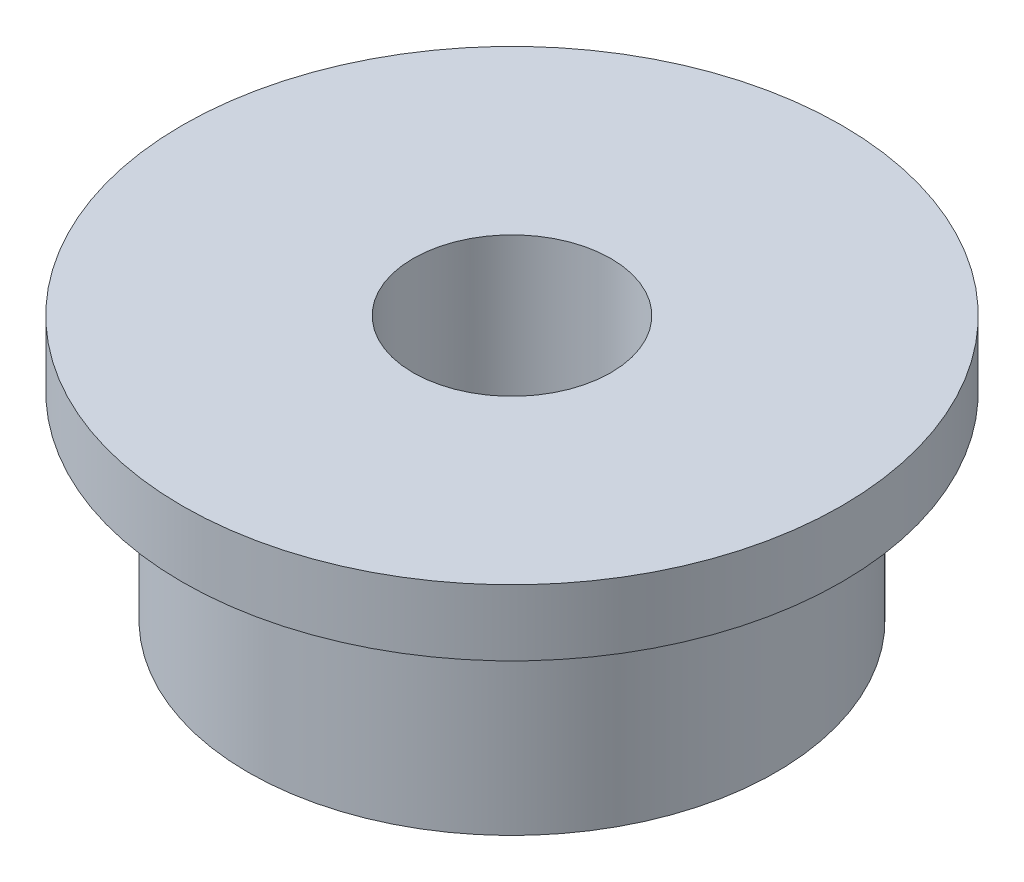
ISO-10303-21;
HEADER;
FILE_DESCRIPTION(('STEP AP214'),'2;1');
FILE_NAME('part.step','',(''),(''),'','','');
FILE_SCHEMA(('AUTOMOTIVE_DESIGN { 1 0 10303 214 1 1 1 1 }'));
ENDSEC;
DATA;
#1=APPLICATION_CONTEXT('core data for automotive mechanical design processes');
#2=APPLICATION_PROTOCOL_DEFINITION('international standard','automotive_design',2000,#1);
#3=PRODUCT_CONTEXT('',#1,'mechanical');
#4=PRODUCT('Part','Part','',(#3));
#5=PRODUCT_RELATED_PRODUCT_CATEGORY('part','',(#4));
#6=PRODUCT_DEFINITION_FORMATION('','',#4);
#7=PRODUCT_DEFINITION_CONTEXT('part definition',#1,'design');
#8=PRODUCT_DEFINITION('design','',#6,#7);
#9=PRODUCT_DEFINITION_SHAPE('','',#8);
#10=(LENGTH_UNIT() NAMED_UNIT(*) SI_UNIT(.MILLI.,.METRE.));
#11=(NAMED_UNIT(*) PLANE_ANGLE_UNIT() SI_UNIT($,.RADIAN.));
#12=(NAMED_UNIT(*) SI_UNIT($,.STERADIAN.) SOLID_ANGLE_UNIT());
#13=UNCERTAINTY_MEASURE_WITH_UNIT(LENGTH_MEASURE(1.E-05),#10,'distance_accuracy_value','');
#14=(GEOMETRIC_REPRESENTATION_CONTEXT(3) GLOBAL_UNCERTAINTY_ASSIGNED_CONTEXT((#13)) GLOBAL_UNIT_ASSIGNED_CONTEXT((#10,
#11,#12)) REPRESENTATION_CONTEXT('',''));
#15=CARTESIAN_POINT('',(0.,0.,0.));
#16=DIRECTION('',(0.,0.,1.));
#17=DIRECTION('',(1.,0.,0.));
#18=AXIS2_PLACEMENT_3D('',#15,#16,#17);
#19=CARTESIAN_POINT('',(0.,0.,0.));
#20=DIRECTION('',(0.,1.,0.));
#21=DIRECTION('',(0.,0.,1.));
#22=AXIS2_PLACEMENT_3D('',#19,#20,#21);
#23=PLANE('',#22);
#24=CARTESIAN_POINT('',(0.,0.,0.));
#25=DIRECTION('',(0.,1.,0.));
#26=DIRECTION('',(0.,0.,1.));
#27=AXIS2_PLACEMENT_3D('',#24,#25,#26);
#28=CIRCLE('',#27,5.);
#29=CARTESIAN_POINT('',(0.,0.,5.));
#30=VERTEX_POINT('',#29);
#31=EDGE_CURVE('E50',#30,#30,#28,.T.);
#32=ORIENTED_EDGE('',*,*,#31,.F.);
#33=EDGE_LOOP('',(#32));
#34=FACE_BOUND('',#33,.T.);
#35=CARTESIAN_POINT('',(0.,0.,0.));
#36=DIRECTION('',(0.,1.,0.));
#37=DIRECTION('',(0.,0.,1.));
#38=AXIS2_PLACEMENT_3D('',#35,#36,#37);
#39=CIRCLE('',#38,4.);
#40=CARTESIAN_POINT('',(0.,0.,4.));
#41=VERTEX_POINT('',#40);
#42=EDGE_CURVE('E10',#41,#41,#39,.F.);
#43=ORIENTED_EDGE('',*,*,#42,.F.);
#44=EDGE_LOOP('',(#43));
#45=FACE_BOUND('',#44,.T.);
#46=ADVANCED_FACE('F39',(#34,#45),#23,.F.);
#47=CARTESIAN_POINT('',(0.,1.,0.));
#48=DIRECTION('',(0.,-1.,0.));
#49=DIRECTION('',(0.,0.,-1.));
#50=AXIS2_PLACEMENT_3D('',#47,#48,#49);
#51=CYLINDRICAL_SURFACE('',#50,5.);
#52=CARTESIAN_POINT('',(0.,1.,0.));
#53=DIRECTION('',(0.,1.,0.));
#54=DIRECTION('',(0.,0.,1.));
#55=AXIS2_PLACEMENT_3D('',#52,#53,#54);
#56=CIRCLE('',#55,5.);
#57=CARTESIAN_POINT('',(0.,1.,5.));
#58=VERTEX_POINT('',#57);
#59=EDGE_CURVE('E46',#58,#58,#56,.T.);
#60=ORIENTED_EDGE('',*,*,#59,.F.);
#61=EDGE_LOOP('',(#60));
#62=FACE_BOUND('',#61,.T.);
#63=ORIENTED_EDGE('',*,*,#31,.T.);
#64=EDGE_LOOP('',(#63));
#65=FACE_BOUND('',#64,.T.);
#66=ADVANCED_FACE('F41',(#62,#65),#51,.T.);
#67=CARTESIAN_POINT('',(0.,1.,0.));
#68=DIRECTION('',(0.,1.,0.));
#69=DIRECTION('',(0.,0.,1.));
#70=AXIS2_PLACEMENT_3D('',#67,#68,#69);
#71=PLANE('',#70);
#72=CARTESIAN_POINT('',(0.,1.,0.));
#73=DIRECTION('',(0.,1.,0.));
#74=DIRECTION('',(0.,0.,1.));
#75=AXIS2_PLACEMENT_3D('',#72,#73,#74);
#76=CIRCLE('',#75,1.5);
#77=CARTESIAN_POINT('',(0.,1.,1.5));
#78=VERTEX_POINT('',#77);
#79=EDGE_CURVE('E59',#78,#78,#76,.T.);
#80=ORIENTED_EDGE('',*,*,#79,.F.);
#81=EDGE_LOOP('',(#80));
#82=FACE_BOUND('',#81,.T.);
#83=ORIENTED_EDGE('',*,*,#59,.T.);
#84=EDGE_LOOP('',(#83));
#85=FACE_BOUND('',#84,.T.);
#86=ADVANCED_FACE('F76',(#82,#85),#71,.T.);
#87=CARTESIAN_POINT('',(0.,-3.,0.));
#88=DIRECTION('',(0.,1.,0.));
#89=DIRECTION('',(0.,0.,1.));
#90=AXIS2_PLACEMENT_3D('',#87,#88,#89);
#91=CYLINDRICAL_SURFACE('',#90,4.);
#92=CARTESIAN_POINT('',(0.,-3.,0.));
#93=DIRECTION('',(0.,-1.,0.));
#94=DIRECTION('',(0.,0.,-1.));
#95=AXIS2_PLACEMENT_3D('',#92,#93,#94);
#96=CIRCLE('',#95,4.);
#97=CARTESIAN_POINT('',(0.,-3.,-4.));
#98=VERTEX_POINT('',#97);
#99=EDGE_CURVE('E55',#98,#98,#96,.T.);
#100=ORIENTED_EDGE('',*,*,#99,.F.);
#101=EDGE_LOOP('',(#100));
#102=FACE_BOUND('',#101,.T.);
#103=ORIENTED_EDGE('',*,*,#42,.T.);
#104=EDGE_LOOP('',(#103));
#105=FACE_BOUND('',#104,.T.);
#106=ADVANCED_FACE('F71',(#102,#105),#91,.T.);
#107=CARTESIAN_POINT('',(0.,-3.,0.));
#108=DIRECTION('',(0.,-1.,0.));
#109=DIRECTION('',(0.,0.,-1.));
#110=AXIS2_PLACEMENT_3D('',#107,#108,#109);
#111=PLANE('',#110);
#112=CARTESIAN_POINT('',(0.,-3.,0.));
#113=DIRECTION('',(0.,-1.,0.));
#114=DIRECTION('',(0.,0.,-1.));
#115=AXIS2_PLACEMENT_3D('',#112,#113,#114);
#116=CIRCLE('',#115,1.5);
#117=CARTESIAN_POINT('',(0.,-3.,-1.5));
#118=VERTEX_POINT('',#117);
#119=EDGE_CURVE('E62',#118,#118,#116,.T.);
#120=ORIENTED_EDGE('',*,*,#119,.F.);
#121=EDGE_LOOP('',(#120));
#122=FACE_BOUND('',#121,.T.);
#123=ORIENTED_EDGE('',*,*,#99,.T.);
#124=EDGE_LOOP('',(#123));
#125=FACE_BOUND('',#124,.T.);
#126=ADVANCED_FACE('F68',(#122,#125),#111,.T.);
#127=CARTESIAN_POINT('',(0.,10.,0.));
#128=DIRECTION('',(0.,-1.,0.));
#129=DIRECTION('',(0.,0.,-1.));
#130=AXIS2_PLACEMENT_3D('',#127,#128,#129);
#131=CYLINDRICAL_SURFACE('',#130,1.5);
#132=ORIENTED_EDGE('',*,*,#79,.T.);
#133=EDGE_LOOP('',(#132));
#134=FACE_BOUND('',#133,.T.);
#135=ORIENTED_EDGE('',*,*,#119,.T.);
#136=EDGE_LOOP('',(#135));
#137=FACE_BOUND('',#136,.T.);
#138=ADVANCED_FACE('F66',(#134,#137),#131,.F.);
#139=CLOSED_SHELL('',(#46,#66,#86,#106,#126,#138));
#140=MANIFOLD_SOLID_BREP('B2',#139);
#141=ADVANCED_BREP_SHAPE_REPRESENTATION('',(#18,#140),#14);
#142=SHAPE_DEFINITION_REPRESENTATION(#9,#141);
ENDSEC;
END-ISO-10303-21;
